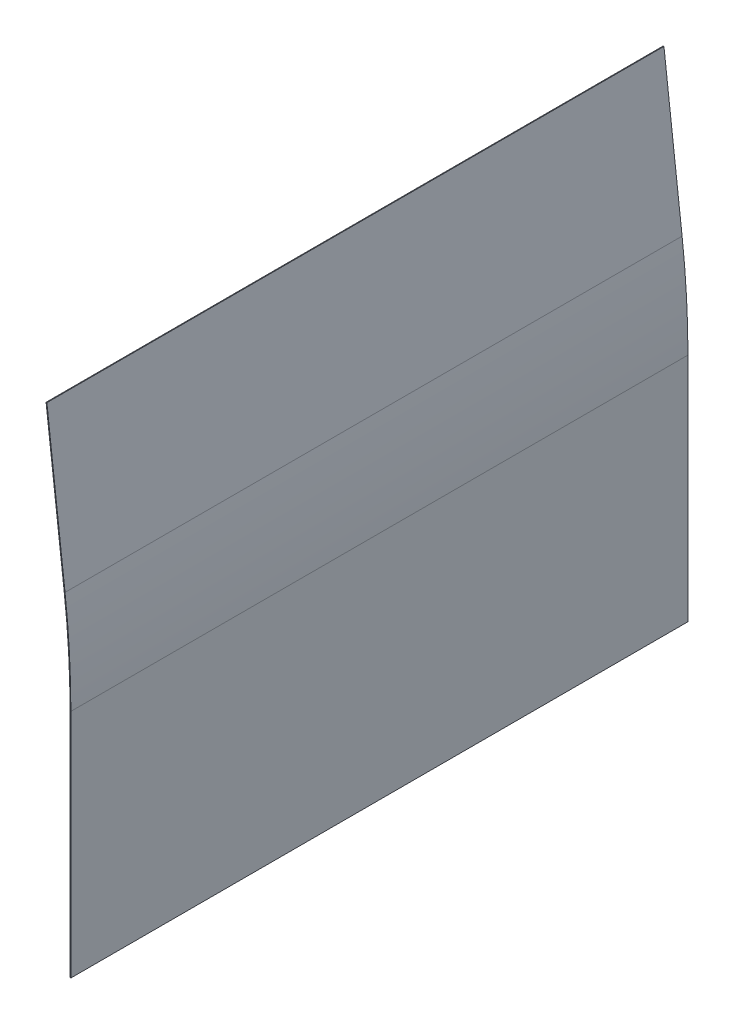
ISO-10303-21;
HEADER;
FILE_DESCRIPTION(('STEP AP214'),'2;1');
FILE_NAME('part.step','',(''),(''),'','','');
FILE_SCHEMA(('AUTOMOTIVE_DESIGN { 1 0 10303 214 1 1 1 1 }'));
ENDSEC;
DATA;
#1=APPLICATION_CONTEXT('core data for automotive mechanical design processes');
#2=APPLICATION_PROTOCOL_DEFINITION('international standard','automotive_design',2000,#1);
#3=PRODUCT_CONTEXT('',#1,'mechanical');
#4=PRODUCT('Part','Part','',(#3));
#5=PRODUCT_RELATED_PRODUCT_CATEGORY('part','',(#4));
#6=PRODUCT_DEFINITION_FORMATION('','',#4);
#7=PRODUCT_DEFINITION_CONTEXT('part definition',#1,'design');
#8=PRODUCT_DEFINITION('design','',#6,#7);
#9=PRODUCT_DEFINITION_SHAPE('','',#8);
#10=(LENGTH_UNIT() NAMED_UNIT(*) SI_UNIT(.MILLI.,.METRE.));
#11=(NAMED_UNIT(*) PLANE_ANGLE_UNIT() SI_UNIT($,.RADIAN.));
#12=(NAMED_UNIT(*) SI_UNIT($,.STERADIAN.) SOLID_ANGLE_UNIT());
#13=UNCERTAINTY_MEASURE_WITH_UNIT(LENGTH_MEASURE(1.E-05),#10,'distance_accuracy_value','');
#14=(GEOMETRIC_REPRESENTATION_CONTEXT(3) GLOBAL_UNCERTAINTY_ASSIGNED_CONTEXT((#13)) GLOBAL_UNIT_ASSIGNED_CONTEXT((#10,
#11,#12)) REPRESENTATION_CONTEXT('',''));
#15=CARTESIAN_POINT('',(0.,0.,0.));
#16=DIRECTION('',(0.,0.,1.));
#17=DIRECTION('',(1.,0.,0.));
#18=AXIS2_PLACEMENT_3D('',#15,#16,#17);
#19=CARTESIAN_POINT('',(-5.00000000000243,429.413496662776,1500.));
#20=DIRECTION('',(0.,0.,1.));
#21=DIRECTION('',(1.,0.,0.));
#22=AXIS2_PLACEMENT_3D('',#19,#20,#21);
#23=PLANE('',#22);
#24=DIRECTION('',(-1.,0.,0.));
#25=VECTOR('',#24,1.);
#26=CARTESIAN_POINT('',(-5.00000000000243,429.413496662776,1500.));
#27=LINE('',#26,#25);
#28=CARTESIAN_POINT('',(-5.00000000000243,429.413496662776,1500.));
#29=VERTEX_POINT('',#28);
#30=CARTESIAN_POINT('',(-7.00000000000243,429.413496662776,1500.));
#31=VERTEX_POINT('',#30);
#32=EDGE_CURVE('E11',#29,#31,#27,.T.);
#33=ORIENTED_EDGE('',*,*,#32,.F.);
#34=CARTESIAN_POINT('',(-2100.,429.413496662785,1500.));
#35=DIRECTION('',(0.,0.,-1.));
#36=DIRECTION('',(1.,0.,0.));
#37=AXIS2_PLACEMENT_3D('',#34,#35,#36);
#38=CIRCLE('',#37,2095.);
#39=CARTESIAN_POINT('',(-19.1797937076434,672.749209383758,1500.));
#40=VERTEX_POINT('',#39);
#41=EDGE_CURVE('E133',#40,#29,#38,.T.);
#42=ORIENTED_EDGE('',*,*,#41,.F.);
#43=DIRECTION('',(0.993231602048859,0.116150698196171,0.));
#44=VECTOR('',#43,1.);
#45=CARTESIAN_POINT('',(-21.1662569117408,672.516907987365,1500.));
#46=LINE('',#45,#44);
#47=CARTESIAN_POINT('',(-21.1662569117408,672.516907987365,1500.));
#48=VERTEX_POINT('',#47);
#49=EDGE_CURVE('E44',#48,#40,#46,.T.);
#50=ORIENTED_EDGE('',*,*,#49,.F.);
#51=CARTESIAN_POINT('',(-2100.,429.413496662785,1500.));
#52=DIRECTION('',(0.,0.,1.));
#53=DIRECTION('',(1.,0.,0.));
#54=AXIS2_PLACEMENT_3D('',#51,#52,#53);
#55=CIRCLE('',#54,2093.);
#56=EDGE_CURVE('E126',#48,#31,#55,.F.);
#57=ORIENTED_EDGE('',*,*,#56,.T.);
#58=EDGE_LOOP('',(#33,#42,#50,#57));
#59=FACE_BOUND('',#58,.T.);
#60=ADVANCED_FACE('F36',(#59),#23,.T.);
#61=CARTESIAN_POINT('',(-21.1662569117408,672.516907987365,1500.));
#62=DIRECTION('',(0.,0.,1.));
#63=DIRECTION('',(1.,0.,0.));
#64=AXIS2_PLACEMENT_3D('',#61,#62,#63);
#65=PLANE('',#64);
#66=DIRECTION('',(0.,-1.,0.));
#67=VECTOR('',#66,1.);
#68=CARTESIAN_POINT('',(-5.00000000000243,429.413496662776,1500.));
#69=LINE('',#68,#67);
#70=CARTESIAN_POINT('',(-5.00000000000481,-131.926503337224,1500.));
#71=VERTEX_POINT('',#70);
#72=EDGE_CURVE('E182',#29,#71,#69,.T.);
#73=ORIENTED_EDGE('',*,*,#72,.F.);
#74=ORIENTED_EDGE('',*,*,#32,.T.);
#75=DIRECTION('',(0.,-1.,0.));
#76=VECTOR('',#75,1.);
#77=CARTESIAN_POINT('',(-7.00000000000243,429.413496662776,1500.));
#78=LINE('',#77,#76);
#79=CARTESIAN_POINT('',(-7.00000000000481,-131.926503337224,1500.));
#80=VERTEX_POINT('',#79);
#81=EDGE_CURVE('E92',#31,#80,#78,.T.);
#82=ORIENTED_EDGE('',*,*,#81,.T.);
#83=DIRECTION('',(-1.,0.,0.));
#84=VECTOR('',#83,1.);
#85=CARTESIAN_POINT('',(-5.00000000000481,-131.926503337224,1500.));
#86=LINE('',#85,#84);
#87=EDGE_CURVE('E339',#71,#80,#86,.T.);
#88=ORIENTED_EDGE('',*,*,#87,.F.);
#89=EDGE_LOOP('',(#73,#74,#82,#88));
#90=FACE_BOUND('',#89,.T.);
#91=ADVANCED_FACE('F190',(#90),#65,.T.);
#92=CARTESIAN_POINT('',(-19.1797937076434,672.749209383758,0.));
#93=DIRECTION('',(0.,0.,-1.));
#94=DIRECTION('',(-1.,0.,0.));
#95=AXIS2_PLACEMENT_3D('',#92,#93,#94);
#96=PLANE('',#95);
#97=DIRECTION('',(-0.993231602048859,-0.116150698196171,0.));
#98=VECTOR('',#97,1.);
#99=CARTESIAN_POINT('',(-19.1797937076434,672.749209383758,0.));
#100=LINE('',#99,#98);
#101=CARTESIAN_POINT('',(-19.1797937076434,672.749209383758,0.));
#102=VERTEX_POINT('',#101);
#103=CARTESIAN_POINT('',(-21.1662569117408,672.516907987365,0.));
#104=VERTEX_POINT('',#103);
#105=EDGE_CURVE('E79',#102,#104,#100,.T.);
#106=ORIENTED_EDGE('',*,*,#105,.F.);
#107=CARTESIAN_POINT('',(-2100.,429.413496662785,0.));
#108=DIRECTION('',(0.,0.,-1.));
#109=DIRECTION('',(1.,0.,0.));
#110=AXIS2_PLACEMENT_3D('',#107,#108,#109);
#111=CIRCLE('',#110,2095.);
#112=CARTESIAN_POINT('',(-5.00000000000243,429.413496662776,0.));
#113=VERTEX_POINT('',#112);
#114=EDGE_CURVE('E148',#102,#113,#111,.T.);
#115=ORIENTED_EDGE('',*,*,#114,.T.);
#116=DIRECTION('',(1.,0.,0.));
#117=VECTOR('',#116,1.);
#118=CARTESIAN_POINT('',(-7.00000000000243,429.413496662776,0.));
#119=LINE('',#118,#117);
#120=CARTESIAN_POINT('',(-7.00000000000243,429.413496662776,0.));
#121=VERTEX_POINT('',#120);
#122=EDGE_CURVE('E86',#121,#113,#119,.T.);
#123=ORIENTED_EDGE('',*,*,#122,.F.);
#124=CARTESIAN_POINT('',(-2100.,429.413496662785,0.));
#125=DIRECTION('',(0.,0.,1.));
#126=DIRECTION('',(1.,0.,0.));
#127=AXIS2_PLACEMENT_3D('',#124,#125,#126);
#128=CIRCLE('',#127,2093.);
#129=EDGE_CURVE('E155',#104,#121,#128,.F.);
#130=ORIENTED_EDGE('',*,*,#129,.F.);
#131=EDGE_LOOP('',(#106,#115,#123,#130));
#132=FACE_BOUND('',#131,.T.);
#133=ADVANCED_FACE('F188',(#132),#96,.T.);
#134=CARTESIAN_POINT('',(-7.00000000000243,429.413496662776,0.));
#135=DIRECTION('',(0.,0.,-1.));
#136=DIRECTION('',(-1.,0.,0.));
#137=AXIS2_PLACEMENT_3D('',#134,#135,#136);
#138=PLANE('',#137);
#139=DIRECTION('',(0.11615069819406,-0.993231602049105,0.));
#140=VECTOR('',#139,1.);
#141=CARTESIAN_POINT('',(-63.3170590213878,1050.17721816243,0.));
#142=LINE('',#141,#140);
#143=CARTESIAN_POINT('',(-63.3170590213878,1050.17721816243,0.));
#144=VERTEX_POINT('',#143);
#145=EDGE_CURVE('E150',#144,#102,#142,.T.);
#146=ORIENTED_EDGE('',*,*,#145,.T.);
#147=ORIENTED_EDGE('',*,*,#105,.T.);
#148=DIRECTION('',(0.11615069819406,-0.993231602049105,0.));
#149=VECTOR('',#148,1.);
#150=CARTESIAN_POINT('',(-65.303522225486,1049.94491676604,0.));
#151=LINE('',#150,#149);
#152=CARTESIAN_POINT('',(-65.303522225486,1049.94491676604,0.));
#153=VERTEX_POINT('',#152);
#154=EDGE_CURVE('E153',#153,#104,#151,.T.);
#155=ORIENTED_EDGE('',*,*,#154,.F.);
#156=DIRECTION('',(0.993231602049108,0.11615069819404,0.));
#157=VECTOR('',#156,1.);
#158=CARTESIAN_POINT('',(-65.303522225486,1049.94491676604,0.));
#159=LINE('',#158,#157);
#160=EDGE_CURVE('E114',#153,#144,#159,.T.);
#161=ORIENTED_EDGE('',*,*,#160,.T.);
#162=EDGE_LOOP('',(#146,#147,#155,#161));
#163=FACE_BOUND('',#162,.T.);
#164=ADVANCED_FACE('F184',(#163),#138,.T.);
#165=CARTESIAN_POINT('',(-7.00000000000243,429.413496662776,1500.));
#166=DIRECTION('',(1.,0.,0.));
#167=DIRECTION('',(0.,1.,0.));
#168=AXIS2_PLACEMENT_3D('',#165,#166,#167);
#169=PLANE('',#168);
#170=DIRECTION('',(0.,-1.,0.));
#171=VECTOR('',#170,1.);
#172=CARTESIAN_POINT('',(-7.00000000000243,429.413496662776,0.));
#173=LINE('',#172,#171);
#174=CARTESIAN_POINT('',(-7.00000000000481,-131.926503337224,0.));
#175=VERTEX_POINT('',#174);
#176=EDGE_CURVE('E139',#121,#175,#173,.T.);
#177=ORIENTED_EDGE('',*,*,#176,.T.);
#178=DIRECTION('',(0.,0.,-1.));
#179=VECTOR('',#178,1.);
#180=CARTESIAN_POINT('',(-7.00000000000481,-131.926503337224,1500.));
#181=LINE('',#180,#179);
#182=EDGE_CURVE('E169',#80,#175,#181,.T.);
#183=ORIENTED_EDGE('',*,*,#182,.F.);
#184=ORIENTED_EDGE('',*,*,#81,.F.);
#185=DIRECTION('',(0.,0.,-1.));
#186=VECTOR('',#185,1.);
#187=CARTESIAN_POINT('',(-7.00000000000243,429.413496662776,1500.));
#188=LINE('',#187,#186);
#189=EDGE_CURVE('E138',#31,#121,#188,.T.);
#190=ORIENTED_EDGE('',*,*,#189,.T.);
#191=EDGE_LOOP('',(#177,#183,#184,#190));
#192=FACE_BOUND('',#191,.T.);
#193=ADVANCED_FACE('F196',(#192),#169,.F.);
#194=CARTESIAN_POINT('',(-5.00000000000481,-131.926503337224,1500.));
#195=DIRECTION('',(0.,-1.,0.));
#196=DIRECTION('',(0.,0.,-1.));
#197=AXIS2_PLACEMENT_3D('',#194,#195,#196);
#198=PLANE('',#197);
#199=DIRECTION('',(-1.,0.,0.));
#200=VECTOR('',#199,1.);
#201=CARTESIAN_POINT('',(-5.00000000000481,-131.926503337224,0.));
#202=LINE('',#201,#200);
#203=CARTESIAN_POINT('',(-5.00000000000481,-131.926503337224,0.));
#204=VERTEX_POINT('',#203);
#205=EDGE_CURVE('E142',#204,#175,#202,.T.);
#206=ORIENTED_EDGE('',*,*,#205,.F.);
#207=DIRECTION('',(0.,0.,-1.));
#208=VECTOR('',#207,1.);
#209=CARTESIAN_POINT('',(-5.00000000000481,-131.926503337224,1500.));
#210=LINE('',#209,#208);
#211=EDGE_CURVE('E167',#71,#204,#210,.T.);
#212=ORIENTED_EDGE('',*,*,#211,.F.);
#213=ORIENTED_EDGE('',*,*,#87,.T.);
#214=ORIENTED_EDGE('',*,*,#182,.T.);
#215=EDGE_LOOP('',(#206,#212,#213,#214));
#216=FACE_BOUND('',#215,.T.);
#217=ADVANCED_FACE('F227',(#216),#198,.T.);
#218=CARTESIAN_POINT('',(-5.00000000000243,429.413496662776,1500.));
#219=DIRECTION('',(1.,0.,0.));
#220=DIRECTION('',(0.,1.,0.));
#221=AXIS2_PLACEMENT_3D('',#218,#219,#220);
#222=PLANE('',#221);
#223=DIRECTION('',(0.,-1.,0.));
#224=VECTOR('',#223,1.);
#225=CARTESIAN_POINT('',(-5.00000000000243,429.413496662776,0.));
#226=LINE('',#225,#224);
#227=EDGE_CURVE('E145',#113,#204,#226,.T.);
#228=ORIENTED_EDGE('',*,*,#227,.F.);
#229=DIRECTION('',(0.,0.,-1.));
#230=VECTOR('',#229,1.);
#231=CARTESIAN_POINT('',(-5.00000000000243,429.413496662776,1500.));
#232=LINE('',#231,#230);
#233=EDGE_CURVE('E164',#29,#113,#232,.T.);
#234=ORIENTED_EDGE('',*,*,#233,.F.);
#235=ORIENTED_EDGE('',*,*,#72,.T.);
#236=ORIENTED_EDGE('',*,*,#211,.T.);
#237=EDGE_LOOP('',(#228,#234,#235,#236));
#238=FACE_BOUND('',#237,.T.);
#239=ADVANCED_FACE('F238',(#238),#222,.T.);
#240=CARTESIAN_POINT('',(-2100.,429.413496662785,1500.));
#241=DIRECTION('',(0.,0.,-1.));
#242=DIRECTION('',(-1.,0.,0.));
#243=AXIS2_PLACEMENT_3D('',#240,#241,#242);
#244=CYLINDRICAL_SURFACE('',#243,2095.);
#245=ORIENTED_EDGE('',*,*,#114,.F.);
#246=DIRECTION('',(0.,0.,-1.));
#247=VECTOR('',#246,1.);
#248=CARTESIAN_POINT('',(-19.1797937076434,672.749209383758,1500.));
#249=LINE('',#248,#247);
#250=EDGE_CURVE('E161',#40,#102,#249,.T.);
#251=ORIENTED_EDGE('',*,*,#250,.F.);
#252=ORIENTED_EDGE('',*,*,#41,.T.);
#253=ORIENTED_EDGE('',*,*,#233,.T.);
#254=EDGE_LOOP('',(#245,#251,#252,#253));
#255=FACE_BOUND('',#254,.T.);
#256=ADVANCED_FACE('F178',(#255),#244,.T.);
#257=CARTESIAN_POINT('',(-63.3170590213878,1050.17721816243,1500.));
#258=DIRECTION('',(0.993231602049105,0.11615069819406,0.));
#259=DIRECTION('',(-0.11615069819406,0.993231602049105,0.));
#260=AXIS2_PLACEMENT_3D('',#257,#258,#259);
#261=PLANE('',#260);
#262=ORIENTED_EDGE('',*,*,#145,.F.);
#263=DIRECTION('',(0.,0.,-1.));
#264=VECTOR('',#263,1.);
#265=CARTESIAN_POINT('',(-63.3170590213878,1050.17721816243,1500.));
#266=LINE('',#265,#264);
#267=CARTESIAN_POINT('',(-63.3170590213878,1050.17721816243,1500.));
#268=VERTEX_POINT('',#267);
#269=EDGE_CURVE('E116',#268,#144,#266,.T.);
#270=ORIENTED_EDGE('',*,*,#269,.F.);
#271=DIRECTION('',(0.11615069819406,-0.993231602049105,0.));
#272=VECTOR('',#271,1.);
#273=CARTESIAN_POINT('',(-63.3170590213878,1050.17721816243,1500.));
#274=LINE('',#273,#272);
#275=EDGE_CURVE('E131',#268,#40,#274,.T.);
#276=ORIENTED_EDGE('',*,*,#275,.T.);
#277=ORIENTED_EDGE('',*,*,#250,.T.);
#278=EDGE_LOOP('',(#262,#270,#276,#277));
#279=FACE_BOUND('',#278,.T.);
#280=ADVANCED_FACE('F183',(#279),#261,.T.);
#281=CARTESIAN_POINT('',(-65.303522225486,1049.94491676604,1500.));
#282=DIRECTION('',(-0.11615069819404,0.993231602049108,0.));
#283=DIRECTION('',(-0.993231602049108,-0.11615069819404,0.));
#284=AXIS2_PLACEMENT_3D('',#281,#282,#283);
#285=PLANE('',#284);
#286=ORIENTED_EDGE('',*,*,#160,.F.);
#287=DIRECTION('',(0.,0.,-1.));
#288=VECTOR('',#287,1.);
#289=CARTESIAN_POINT('',(-65.303522225486,1049.94491676604,1500.));
#290=LINE('',#289,#288);
#291=CARTESIAN_POINT('',(-65.303522225486,1049.94491676604,1500.));
#292=VERTEX_POINT('',#291);
#293=EDGE_CURVE('E108',#292,#153,#290,.T.);
#294=ORIENTED_EDGE('',*,*,#293,.F.);
#295=DIRECTION('',(0.993231602049108,0.11615069819404,0.));
#296=VECTOR('',#295,1.);
#297=CARTESIAN_POINT('',(-65.303522225486,1049.94491676604,1500.));
#298=LINE('',#297,#296);
#299=EDGE_CURVE('E112',#292,#268,#298,.T.);
#300=ORIENTED_EDGE('',*,*,#299,.T.);
#301=ORIENTED_EDGE('',*,*,#269,.T.);
#302=EDGE_LOOP('',(#286,#294,#300,#301));
#303=FACE_BOUND('',#302,.T.);
#304=ADVANCED_FACE('F110',(#303),#285,.T.);
#305=CARTESIAN_POINT('',(-65.303522225486,1049.94491676604,1500.));
#306=DIRECTION('',(0.993231602049105,0.11615069819406,0.));
#307=DIRECTION('',(-0.11615069819406,0.993231602049105,0.));
#308=AXIS2_PLACEMENT_3D('',#305,#306,#307);
#309=PLANE('',#308);
#310=ORIENTED_EDGE('',*,*,#154,.T.);
#311=DIRECTION('',(0.,0.,-1.));
#312=VECTOR('',#311,1.);
#313=CARTESIAN_POINT('',(-21.1662569117408,672.516907987365,1500.));
#314=LINE('',#313,#312);
#315=EDGE_CURVE('E117',#48,#104,#314,.T.);
#316=ORIENTED_EDGE('',*,*,#315,.F.);
#317=DIRECTION('',(0.11615069819406,-0.993231602049105,0.));
#318=VECTOR('',#317,1.);
#319=CARTESIAN_POINT('',(-65.303522225486,1049.94491676604,1500.));
#320=LINE('',#319,#318);
#321=EDGE_CURVE('E121',#292,#48,#320,.T.);
#322=ORIENTED_EDGE('',*,*,#321,.F.);
#323=ORIENTED_EDGE('',*,*,#293,.T.);
#324=EDGE_LOOP('',(#310,#316,#322,#323));
#325=FACE_BOUND('',#324,.T.);
#326=ADVANCED_FACE('F122',(#325),#309,.F.);
#327=CARTESIAN_POINT('',(-2100.,429.413496662785,1500.));
#328=DIRECTION('',(0.,0.,-1.));
#329=DIRECTION('',(-1.,0.,0.));
#330=AXIS2_PLACEMENT_3D('',#327,#328,#329);
#331=CYLINDRICAL_SURFACE('',#330,2093.);
#332=ORIENTED_EDGE('',*,*,#129,.T.);
#333=ORIENTED_EDGE('',*,*,#189,.F.);
#334=ORIENTED_EDGE('',*,*,#56,.F.);
#335=ORIENTED_EDGE('',*,*,#315,.T.);
#336=EDGE_LOOP('',(#332,#333,#334,#335));
#337=FACE_BOUND('',#336,.T.);
#338=ADVANCED_FACE('F186',(#337),#331,.F.);
#339=CARTESIAN_POINT('',(-2100.,429.413496662785,1500.));
#340=DIRECTION('',(0.,0.,-1.));
#341=DIRECTION('',(-1.,0.,0.));
#342=AXIS2_PLACEMENT_3D('',#339,#340,#341);
#343=PLANE('',#342);
#344=ORIENTED_EDGE('',*,*,#321,.T.);
#345=ORIENTED_EDGE('',*,*,#49,.T.);
#346=ORIENTED_EDGE('',*,*,#275,.F.);
#347=ORIENTED_EDGE('',*,*,#299,.F.);
#348=EDGE_LOOP('',(#344,#345,#346,#347));
#349=FACE_BOUND('',#348,.T.);
#350=ADVANCED_FACE('F129',(#349),#343,.F.);
#351=CARTESIAN_POINT('',(-2100.,429.413496662785,0.));
#352=DIRECTION('',(0.,0.,-1.));
#353=DIRECTION('',(-1.,0.,0.));
#354=AXIS2_PLACEMENT_3D('',#351,#352,#353);
#355=PLANE('',#354);
#356=ORIENTED_EDGE('',*,*,#176,.F.);
#357=ORIENTED_EDGE('',*,*,#122,.T.);
#358=ORIENTED_EDGE('',*,*,#227,.T.);
#359=ORIENTED_EDGE('',*,*,#205,.T.);
#360=EDGE_LOOP('',(#356,#357,#358,#359));
#361=FACE_BOUND('',#360,.T.);
#362=ADVANCED_FACE('F304',(#361),#355,.T.);
#363=CLOSED_SHELL('',(#60,#91,#133,#164,#193,#217,#239,#256,#280,#304,#326,#338,#350,#362));
#364=MANIFOLD_SOLID_BREP('B2',#363);
#365=ADVANCED_BREP_SHAPE_REPRESENTATION('',(#18,#364),#14);
#366=SHAPE_DEFINITION_REPRESENTATION(#9,#365);
ENDSEC;
END-ISO-10303-21;
